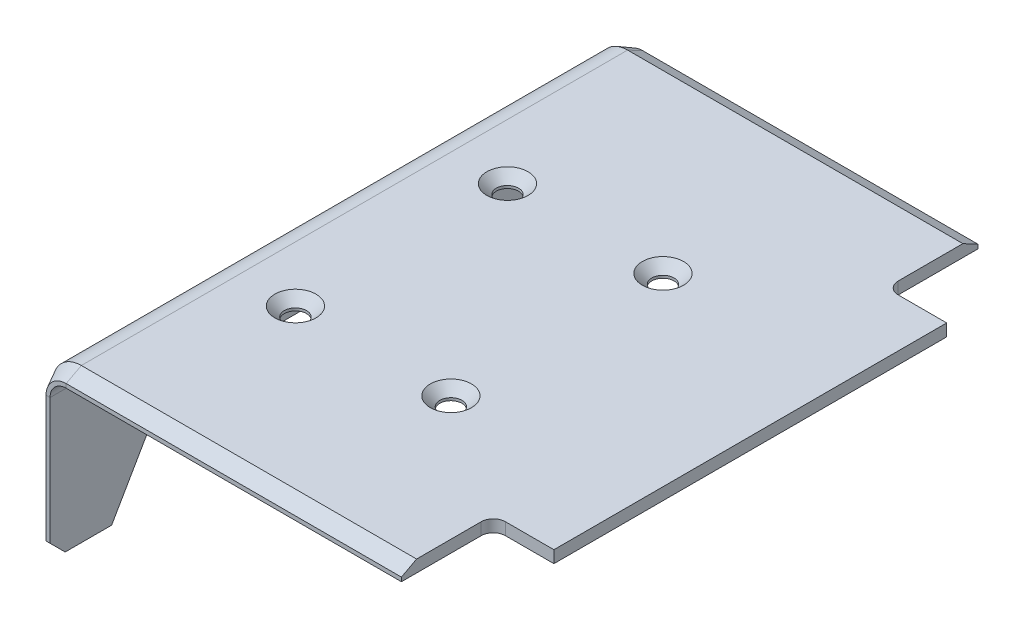
ISO-10303-21;
HEADER;
FILE_DESCRIPTION(('STEP AP214'),'2;1');
FILE_NAME('part.step','',(''),(''),'','','');
FILE_SCHEMA(('AUTOMOTIVE_DESIGN { 1 0 10303 214 1 1 1 1 }'));
ENDSEC;
DATA;
#1=APPLICATION_CONTEXT('core data for automotive mechanical design processes');
#2=APPLICATION_PROTOCOL_DEFINITION('international standard','automotive_design',2000,#1);
#3=PRODUCT_CONTEXT('',#1,'mechanical');
#4=PRODUCT('Part','Part','',(#3));
#5=PRODUCT_RELATED_PRODUCT_CATEGORY('part','',(#4));
#6=PRODUCT_DEFINITION_FORMATION('','',#4);
#7=PRODUCT_DEFINITION_CONTEXT('part definition',#1,'design');
#8=PRODUCT_DEFINITION('design','',#6,#7);
#9=PRODUCT_DEFINITION_SHAPE('','',#8);
#10=(LENGTH_UNIT() NAMED_UNIT(*) SI_UNIT(.MILLI.,.METRE.));
#11=(NAMED_UNIT(*) PLANE_ANGLE_UNIT() SI_UNIT($,.RADIAN.));
#12=(NAMED_UNIT(*) SI_UNIT($,.STERADIAN.) SOLID_ANGLE_UNIT());
#13=UNCERTAINTY_MEASURE_WITH_UNIT(LENGTH_MEASURE(1.E-05),#10,'distance_accuracy_value','');
#14=(GEOMETRIC_REPRESENTATION_CONTEXT(3) GLOBAL_UNCERTAINTY_ASSIGNED_CONTEXT((#13)) GLOBAL_UNIT_ASSIGNED_CONTEXT((#10,
#11,#12)) REPRESENTATION_CONTEXT('',''));
#15=CARTESIAN_POINT('',(0.,0.,0.));
#16=DIRECTION('',(0.,0.,1.));
#17=DIRECTION('',(1.,0.,0.));
#18=AXIS2_PLACEMENT_3D('',#15,#16,#17);
#19=CARTESIAN_POINT('',(-91.,70.,142.75));
#20=DIRECTION('',(0.,0.,-1.));
#21=DIRECTION('',(-1.,0.,0.));
#22=AXIS2_PLACEMENT_3D('',#19,#20,#21);
#23=CYLINDRICAL_SURFACE('',#22,14.);
#24=DIRECTION('',(0.,0.,-1.));
#25=VECTOR('',#24,1.);
#26=CARTESIAN_POINT('',(-91.,84.,142.75));
#27=LINE('',#26,#25);
#28=CARTESIAN_POINT('',(-90.9999999999998,84.,135.25));
#29=VERTEX_POINT('',#28);
#30=CARTESIAN_POINT('',(-90.9999999999998,84.,-135.25));
#31=VERTEX_POINT('',#30);
#32=EDGE_CURVE('E229',#29,#31,#27,.T.);
#33=ORIENTED_EDGE('',*,*,#32,.T.);
#34=CARTESIAN_POINT('',(-91.,70.,-135.25));
#35=DIRECTION('',(0.,0.,1.));
#36=DIRECTION('',(1.,0.,0.));
#37=AXIS2_PLACEMENT_3D('',#34,#35,#36);
#38=CIRCLE('',#37,14.);
#39=CARTESIAN_POINT('',(-105.,70.0000000000001,-135.25));
#40=VERTEX_POINT('',#39);
#41=EDGE_CURVE('E541',#31,#40,#38,.T.);
#42=ORIENTED_EDGE('',*,*,#41,.T.);
#43=DIRECTION('',(0.,0.,-1.));
#44=VECTOR('',#43,1.);
#45=CARTESIAN_POINT('',(-105.,69.9999999999999,142.75));
#46=LINE('',#45,#44);
#47=CARTESIAN_POINT('',(-105.,70.0000000000001,135.25));
#48=VERTEX_POINT('',#47);
#49=EDGE_CURVE('E234',#48,#40,#46,.T.);
#50=ORIENTED_EDGE('',*,*,#49,.F.);
#51=CARTESIAN_POINT('',(-91.,70.,135.25));
#52=DIRECTION('',(0.,0.,1.));
#53=DIRECTION('',(1.,0.,0.));
#54=AXIS2_PLACEMENT_3D('',#51,#52,#53);
#55=CIRCLE('',#54,14.);
#56=EDGE_CURVE('E447',#29,#48,#55,.T.);
#57=ORIENTED_EDGE('',*,*,#56,.F.);
#58=EDGE_LOOP('',(#33,#42,#50,#57));
#59=FACE_BOUND('',#58,.T.);
#60=ADVANCED_FACE('F34',(#59),#23,.T.);
#61=CARTESIAN_POINT('',(-105.,0.,142.75));
#62=DIRECTION('',(-1.,0.,0.));
#63=DIRECTION('',(0.,-1.,0.));
#64=AXIS2_PLACEMENT_3D('',#61,#62,#63);
#65=PLANE('',#64);
#66=DIRECTION('',(0.,-1.,0.));
#67=VECTOR('',#66,1.);
#68=CARTESIAN_POINT('',(-105.,70.0000000000001,-135.25));
#69=LINE('',#68,#67);
#70=CARTESIAN_POINT('',(-105.,-2.50000000000083,-135.25));
#71=VERTEX_POINT('',#70);
#72=EDGE_CURVE('E321',#40,#71,#69,.T.);
#73=ORIENTED_EDGE('',*,*,#72,.T.);
#74=DIRECTION('',(0.,0.,1.));
#75=VECTOR('',#74,1.);
#76=CARTESIAN_POINT('',(-105.,-2.5,-142.75));
#77=LINE('',#76,#75);
#78=CARTESIAN_POINT('',(-105.,-2.5,-104.193375672974));
#79=VERTEX_POINT('',#78);
#80=EDGE_CURVE('E267',#71,#79,#77,.T.);
#81=ORIENTED_EDGE('',*,*,#80,.T.);
#82=DIRECTION('',(0.,-0.866025403784436,-0.500000000000004));
#83=VECTOR('',#82,1.);
#84=CARTESIAN_POINT('',(-105.,0.,-102.75));
#85=LINE('',#84,#83);
#86=CARTESIAN_POINT('',(-105.,35.0000000000001,-82.5427405783628));
#87=VERTEX_POINT('',#86);
#88=EDGE_CURVE('E385',#87,#79,#85,.T.);
#89=ORIENTED_EDGE('',*,*,#88,.F.);
#90=CARTESIAN_POINT('',(-105.,25.,-65.2222325026741));
#91=DIRECTION('',(-1.,0.,0.));
#92=DIRECTION('',(0.,0.,-1.));
#93=AXIS2_PLACEMENT_3D('',#90,#91,#92);
#94=CIRCLE('',#93,20.);
#95=CARTESIAN_POINT('',(-105.,45.,-65.2222325026741));
#96=VERTEX_POINT('',#95);
#97=EDGE_CURVE('E397',#96,#87,#94,.T.);
#98=ORIENTED_EDGE('',*,*,#97,.F.);
#99=DIRECTION('',(0.,0.,-1.));
#100=VECTOR('',#99,1.);
#101=CARTESIAN_POINT('',(-105.,45.,-65.2222325026741));
#102=LINE('',#101,#100);
#103=CARTESIAN_POINT('',(-105.,45.,74.7222325026741));
#104=VERTEX_POINT('',#103);
#105=EDGE_CURVE('E391',#104,#96,#102,.T.);
#106=ORIENTED_EDGE('',*,*,#105,.F.);
#107=CARTESIAN_POINT('',(-105.,25.,74.7222325026741));
#108=DIRECTION('',(-1.,0.,0.));
#109=DIRECTION('',(0.,0.,1.));
#110=AXIS2_PLACEMENT_3D('',#107,#108,#109);
#111=CIRCLE('',#110,20.);
#112=CARTESIAN_POINT('',(-105.,35.0000000000001,92.0427405783628));
#113=VERTEX_POINT('',#112);
#114=EDGE_CURVE('E389',#113,#104,#111,.T.);
#115=ORIENTED_EDGE('',*,*,#114,.F.);
#116=DIRECTION('',(0.,0.866025403784436,-0.500000000000004));
#117=VECTOR('',#116,1.);
#118=CARTESIAN_POINT('',(-105.,35.0000000000001,92.0427405783628));
#119=LINE('',#118,#117);
#120=CARTESIAN_POINT('',(-105.,0.,112.25));
#121=VERTEX_POINT('',#120);
#122=EDGE_CURVE('E382',#121,#113,#119,.T.);
#123=ORIENTED_EDGE('',*,*,#122,.F.);
#124=DIRECTION('',(0.,0.,-1.));
#125=VECTOR('',#124,1.);
#126=CARTESIAN_POINT('',(-105.,0.,142.75));
#127=LINE('',#126,#125);
#128=CARTESIAN_POINT('',(-105.,1.94289029309402E-13,135.25));
#129=VERTEX_POINT('',#128);
#130=EDGE_CURVE('E367',#129,#121,#127,.T.);
#131=ORIENTED_EDGE('',*,*,#130,.F.);
#132=DIRECTION('',(0.,-1.,0.));
#133=VECTOR('',#132,1.);
#134=CARTESIAN_POINT('',(-105.,70.0000000000001,135.25));
#135=LINE('',#134,#133);
#136=EDGE_CURVE('E453',#48,#129,#135,.T.);
#137=ORIENTED_EDGE('',*,*,#136,.F.);
#138=ORIENTED_EDGE('',*,*,#49,.T.);
#139=EDGE_LOOP('',(#73,#81,#89,#98,#106,#115,#123,#131,#137,#138));
#140=FACE_BOUND('',#139,.T.);
#141=ADVANCED_FACE('F328',(#140),#65,.T.);
#142=CARTESIAN_POINT('',(-105.,69.9999999999999,-142.75));
#143=DIRECTION('',(0.,0.,-1.));
#144=DIRECTION('',(-1.,0.,0.));
#145=AXIS2_PLACEMENT_3D('',#142,#143,#144);
#146=PLANE('',#145);
#147=DIRECTION('',(1.,0.,0.));
#148=VECTOR('',#147,1.);
#149=CARTESIAN_POINT('',(-105.,69.9999999999999,-142.75));
#150=LINE('',#149,#148);
#151=CARTESIAN_POINT('',(-101.,70.0000000000001,-142.75));
#152=VERTEX_POINT('',#151);
#153=CARTESIAN_POINT('',(-99.,70.,-142.75));
#154=VERTEX_POINT('',#153);
#155=EDGE_CURVE('E240',#152,#154,#150,.T.);
#156=ORIENTED_EDGE('',*,*,#155,.F.);
#157=CARTESIAN_POINT('',(-91.,70.,-142.75));
#158=DIRECTION('',(0.,0.,1.));
#159=DIRECTION('',(1.,0.,0.));
#160=AXIS2_PLACEMENT_3D('',#157,#158,#159);
#161=CIRCLE('',#160,10.);
#162=CARTESIAN_POINT('',(-90.9999999999998,80.,-142.75));
#163=VERTEX_POINT('',#162);
#164=EDGE_CURVE('E500',#163,#152,#161,.T.);
#165=ORIENTED_EDGE('',*,*,#164,.F.);
#166=DIRECTION('',(0.,1.,0.));
#167=VECTOR('',#166,1.);
#168=CARTESIAN_POINT('',(-91.,78.,-142.75));
#169=LINE('',#168,#167);
#170=CARTESIAN_POINT('',(-91.,78.,-142.75));
#171=VERTEX_POINT('',#170);
#172=EDGE_CURVE('E231',#171,#163,#169,.T.);
#173=ORIENTED_EDGE('',*,*,#172,.F.);
#174=CARTESIAN_POINT('',(-91.,70.,-142.75));
#175=DIRECTION('',(0.,0.,1.));
#176=DIRECTION('',(1.,0.,0.));
#177=AXIS2_PLACEMENT_3D('',#174,#175,#176);
#178=CIRCLE('',#177,8.);
#179=EDGE_CURVE('E348',#154,#171,#178,.F.);
#180=ORIENTED_EDGE('',*,*,#179,.F.);
#181=EDGE_LOOP('',(#156,#165,#173,#180));
#182=FACE_BOUND('',#181,.T.);
#183=ADVANCED_FACE('F497',(#182),#146,.T.);
#184=CARTESIAN_POINT('',(-91.,78.,-142.75));
#185=DIRECTION('',(0.,0.,-1.));
#186=DIRECTION('',(-1.,0.,0.));
#187=AXIS2_PLACEMENT_3D('',#184,#185,#186);
#188=PLANE('',#187);
#189=DIRECTION('',(0.,1.,0.));
#190=VECTOR('',#189,1.);
#191=CARTESIAN_POINT('',(-99.,0.,-142.75));
#192=LINE('',#191,#190);
#193=CARTESIAN_POINT('',(-99.,5.00000000000006,-142.75));
#194=VERTEX_POINT('',#193);
#195=EDGE_CURVE('E345',#194,#154,#192,.T.);
#196=ORIENTED_EDGE('',*,*,#195,.F.);
#197=DIRECTION('',(-1.,0.,0.));
#198=VECTOR('',#197,1.);
#199=CARTESIAN_POINT('',(-91.,5.00000000000006,-142.75));
#200=LINE('',#199,#198);
#201=CARTESIAN_POINT('',(-101.,5.00000000000006,-142.75));
#202=VERTEX_POINT('',#201);
#203=EDGE_CURVE('E316',#194,#202,#200,.T.);
#204=ORIENTED_EDGE('',*,*,#203,.T.);
#205=DIRECTION('',(0.,-1.,0.));
#206=VECTOR('',#205,1.);
#207=CARTESIAN_POINT('',(-101.,70.0000000000001,-142.75));
#208=LINE('',#207,#206);
#209=EDGE_CURVE('E324',#152,#202,#208,.T.);
#210=ORIENTED_EDGE('',*,*,#209,.F.);
#211=ORIENTED_EDGE('',*,*,#155,.T.);
#212=EDGE_LOOP('',(#196,#204,#210,#211));
#213=FACE_BOUND('',#212,.T.);
#214=ADVANCED_FACE('F343',(#213),#188,.T.);
#215=CARTESIAN_POINT('',(-91.,84.,142.75));
#216=DIRECTION('',(0.,0.,1.));
#217=DIRECTION('',(1.,0.,0.));
#218=AXIS2_PLACEMENT_3D('',#215,#216,#217);
#219=PLANE('',#218);
#220=DIRECTION('',(0.,-1.,0.));
#221=VECTOR('',#220,1.);
#222=CARTESIAN_POINT('',(-91.,84.,142.75));
#223=LINE('',#222,#221);
#224=CARTESIAN_POINT('',(-90.9999999999998,80.,142.75));
#225=VERTEX_POINT('',#224);
#226=CARTESIAN_POINT('',(-91.,78.,142.75));
#227=VERTEX_POINT('',#226);
#228=EDGE_CURVE('E246',#225,#227,#223,.T.);
#229=ORIENTED_EDGE('',*,*,#228,.F.);
#230=CARTESIAN_POINT('',(-91.,70.,142.75));
#231=DIRECTION('',(0.,0.,1.));
#232=DIRECTION('',(1.,0.,0.));
#233=AXIS2_PLACEMENT_3D('',#230,#231,#232);
#234=CIRCLE('',#233,10.);
#235=CARTESIAN_POINT('',(-101.,70.0000000000001,142.75));
#236=VERTEX_POINT('',#235);
#237=EDGE_CURVE('E445',#225,#236,#234,.T.);
#238=ORIENTED_EDGE('',*,*,#237,.T.);
#239=DIRECTION('',(-1.,0.,0.));
#240=VECTOR('',#239,1.);
#241=CARTESIAN_POINT('',(-99.,70.,142.75));
#242=LINE('',#241,#240);
#243=CARTESIAN_POINT('',(-99.,70.,142.75));
#244=VERTEX_POINT('',#243);
#245=EDGE_CURVE('E243',#244,#236,#242,.T.);
#246=ORIENTED_EDGE('',*,*,#245,.F.);
#247=CARTESIAN_POINT('',(-91.,70.,142.75));
#248=DIRECTION('',(0.,0.,1.));
#249=DIRECTION('',(1.,0.,0.));
#250=AXIS2_PLACEMENT_3D('',#247,#248,#249);
#251=CIRCLE('',#250,8.);
#252=EDGE_CURVE('E363',#244,#227,#251,.F.);
#253=ORIENTED_EDGE('',*,*,#252,.T.);
#254=EDGE_LOOP('',(#229,#238,#246,#253));
#255=FACE_BOUND('',#254,.T.);
#256=ADVANCED_FACE('F416',(#255),#219,.T.);
#257=CARTESIAN_POINT('',(-99.,0.,142.75));
#258=DIRECTION('',(0.,-1.,0.));
#259=DIRECTION('',(1.,0.,0.));
#260=AXIS2_PLACEMENT_3D('',#257,#258,#259);
#261=PLANE('',#260);
#262=DIRECTION('',(0.,0.,-1.));
#263=VECTOR('',#262,1.);
#264=CARTESIAN_POINT('',(-99.,0.,142.75));
#265=LINE('',#264,#263);
#266=CARTESIAN_POINT('',(-99.,0.,135.25));
#267=VERTEX_POINT('',#266);
#268=CARTESIAN_POINT('',(-99.,0.,112.25));
#269=VERTEX_POINT('',#268);
#270=EDGE_CURVE('E365',#267,#269,#265,.T.);
#271=ORIENTED_EDGE('',*,*,#270,.F.);
#272=DIRECTION('',(-1.,0.,0.));
#273=VECTOR('',#272,1.);
#274=CARTESIAN_POINT('',(-99.,0.,135.25));
#275=LINE('',#274,#273);
#276=EDGE_CURVE('E306',#267,#129,#275,.T.);
#277=ORIENTED_EDGE('',*,*,#276,.T.);
#278=ORIENTED_EDGE('',*,*,#130,.T.);
#279=DIRECTION('',(-1.,0.,0.));
#280=VECTOR('',#279,1.);
#281=CARTESIAN_POINT('',(105.,0.,112.25));
#282=LINE('',#281,#280);
#283=EDGE_CURVE('E374',#269,#121,#282,.T.);
#284=ORIENTED_EDGE('',*,*,#283,.F.);
#285=EDGE_LOOP('',(#271,#277,#278,#284));
#286=FACE_BOUND('',#285,.T.);
#287=ADVANCED_FACE('F373',(#286),#261,.T.);
#288=CARTESIAN_POINT('',(-91.,70.,142.75));
#289=DIRECTION('',(0.,0.,1.));
#290=DIRECTION('',(1.,0.,0.));
#291=AXIS2_PLACEMENT_3D('',#288,#289,#290);
#292=PLANE('',#291);
#293=DIRECTION('',(0.,-1.,0.));
#294=VECTOR('',#293,1.);
#295=CARTESIAN_POINT('',(-101.,70.0000000000001,142.75));
#296=LINE('',#295,#294);
#297=CARTESIAN_POINT('',(-101.,7.50000000000001,142.75));
#298=VERTEX_POINT('',#297);
#299=EDGE_CURVE('E450',#236,#298,#296,.T.);
#300=ORIENTED_EDGE('',*,*,#299,.T.);
#301=DIRECTION('',(1.,0.,0.));
#302=VECTOR('',#301,1.);
#303=CARTESIAN_POINT('',(-91.,7.50000000000001,142.75));
#304=LINE('',#303,#302);
#305=CARTESIAN_POINT('',(-99.,7.50000000000001,142.75));
#306=VERTEX_POINT('',#305);
#307=EDGE_CURVE('E311',#298,#306,#304,.T.);
#308=ORIENTED_EDGE('',*,*,#307,.T.);
#309=DIRECTION('',(0.,1.,0.));
#310=VECTOR('',#309,1.);
#311=CARTESIAN_POINT('',(-99.,0.,142.75));
#312=LINE('',#311,#310);
#313=EDGE_CURVE('E409',#306,#244,#312,.T.);
#314=ORIENTED_EDGE('',*,*,#313,.T.);
#315=ORIENTED_EDGE('',*,*,#245,.T.);
#316=EDGE_LOOP('',(#300,#308,#314,#315));
#317=FACE_BOUND('',#316,.T.);
#318=ADVANCED_FACE('F495',(#317),#292,.T.);
#319=CARTESIAN_POINT('',(-99.,70.,142.75));
#320=DIRECTION('',(0.,0.,1.));
#321=DIRECTION('',(1.,0.,0.));
#322=AXIS2_PLACEMENT_3D('',#319,#320,#321);
#323=PLANE('',#322);
#324=DIRECTION('',(0.,1.,0.));
#325=VECTOR('',#324,1.);
#326=CARTESIAN_POINT('',(75.0000000000002,-2.50000000000082,142.75));
#327=LINE('',#326,#325);
#328=CARTESIAN_POINT('',(75.0000000000002,78.,142.75));
#329=VERTEX_POINT('',#328);
#330=CARTESIAN_POINT('',(75.0000000000002,80.,142.75));
#331=VERTEX_POINT('',#330);
#332=EDGE_CURVE('E212',#329,#331,#327,.T.);
#333=ORIENTED_EDGE('',*,*,#332,.T.);
#334=DIRECTION('',(1.,0.,0.));
#335=VECTOR('',#334,1.);
#336=CARTESIAN_POINT('',(-90.9999999999998,80.,142.75));
#337=LINE('',#336,#335);
#338=EDGE_CURVE('E433',#225,#331,#337,.T.);
#339=ORIENTED_EDGE('',*,*,#338,.F.);
#340=ORIENTED_EDGE('',*,*,#228,.T.);
#341=DIRECTION('',(1.,0.,0.));
#342=VECTOR('',#341,1.);
#343=CARTESIAN_POINT('',(-105.,78.,142.75));
#344=LINE('',#343,#342);
#345=EDGE_CURVE('E352',#227,#329,#344,.T.);
#346=ORIENTED_EDGE('',*,*,#345,.T.);
#347=EDGE_LOOP('',(#333,#339,#340,#346));
#348=FACE_BOUND('',#347,.T.);
#349=ADVANCED_FACE('F430',(#348),#323,.T.);
#350=CARTESIAN_POINT('',(-105.,78.,142.75));
#351=DIRECTION('',(0.,1.,0.));
#352=DIRECTION('',(0.,0.,1.));
#353=AXIS2_PLACEMENT_3D('',#350,#351,#352);
#354=PLANE('',#353);
#355=CARTESIAN_POINT('',(-63.5,78.,-48.25));
#356=DIRECTION('',(0.,1.,0.));
#357=DIRECTION('',(0.,0.,1.));
#358=AXIS2_PLACEMENT_3D('',#355,#356,#357);
#359=CIRCLE('',#358,5.49999999999998);
#360=CARTESIAN_POINT('',(-63.5,78.,-42.75));
#361=VERTEX_POINT('',#360);
#362=EDGE_CURVE('E279',#361,#361,#359,.T.);
#363=ORIENTED_EDGE('',*,*,#362,.T.);
#364=EDGE_LOOP('',(#363));
#365=FACE_BOUND('',#364,.T.);
#366=CARTESIAN_POINT('',(13.5,78.,-48.25));
#367=DIRECTION('',(0.,1.,0.));
#368=DIRECTION('',(0.,0.,1.));
#369=AXIS2_PLACEMENT_3D('',#366,#367,#368);
#370=CIRCLE('',#369,5.49999999999998);
#371=CARTESIAN_POINT('',(13.5,78.,-42.75));
#372=VERTEX_POINT('',#371);
#373=EDGE_CURVE('E274',#372,#372,#370,.T.);
#374=ORIENTED_EDGE('',*,*,#373,.T.);
#375=EDGE_LOOP('',(#374));
#376=FACE_BOUND('',#375,.T.);
#377=CARTESIAN_POINT('',(13.5,78.,56.75));
#378=DIRECTION('',(0.,1.,0.));
#379=DIRECTION('',(0.,0.,1.));
#380=AXIS2_PLACEMENT_3D('',#377,#378,#379);
#381=CIRCLE('',#380,5.49999999999998);
#382=CARTESIAN_POINT('',(13.5,78.,62.25));
#383=VERTEX_POINT('',#382);
#384=EDGE_CURVE('E269',#383,#383,#381,.T.);
#385=ORIENTED_EDGE('',*,*,#384,.T.);
#386=EDGE_LOOP('',(#385));
#387=FACE_BOUND('',#386,.T.);
#388=CARTESIAN_POINT('',(-63.5,78.,56.75));
#389=DIRECTION('',(0.,1.,0.));
#390=DIRECTION('',(0.,0.,1.));
#391=AXIS2_PLACEMENT_3D('',#388,#389,#390);
#392=CIRCLE('',#391,5.49999999999998);
#393=CARTESIAN_POINT('',(-63.5,78.,62.25));
#394=VERTEX_POINT('',#393);
#395=EDGE_CURVE('E264',#394,#394,#392,.T.);
#396=ORIENTED_EDGE('',*,*,#395,.T.);
#397=EDGE_LOOP('',(#396));
#398=FACE_BOUND('',#397,.T.);
#399=DIRECTION('',(-1.,0.,0.));
#400=VECTOR('',#399,1.);
#401=CARTESIAN_POINT('',(-105.,78.,97.25));
#402=LINE('',#401,#400);
#403=CARTESIAN_POINT('',(105.,78.,97.25));
#404=VERTEX_POINT('',#403);
#405=CARTESIAN_POINT('',(81.0000000000003,78.,97.25));
#406=VERTEX_POINT('',#405);
#407=EDGE_CURVE('E207',#404,#406,#402,.T.);
#408=ORIENTED_EDGE('',*,*,#407,.T.);
#409=CARTESIAN_POINT('',(81.0000000000003,78.,103.25));
#410=DIRECTION('',(0.,1.,0.));
#411=DIRECTION('',(0.,0.,1.));
#412=AXIS2_PLACEMENT_3D('',#409,#410,#411);
#413=CIRCLE('',#412,6.);
#414=CARTESIAN_POINT('',(75.0000000000003,78.,103.25));
#415=VERTEX_POINT('',#414);
#416=EDGE_CURVE('E304',#406,#415,#413,.T.);
#417=ORIENTED_EDGE('',*,*,#416,.T.);
#418=DIRECTION('',(0.,0.,1.));
#419=VECTOR('',#418,1.);
#420=CARTESIAN_POINT('',(75.0000000000003,78.,142.75));
#421=LINE('',#420,#419);
#422=EDGE_CURVE('E426',#415,#329,#421,.T.);
#423=ORIENTED_EDGE('',*,*,#422,.T.);
#424=ORIENTED_EDGE('',*,*,#345,.F.);
#425=DIRECTION('',(0.,0.,-1.));
#426=VECTOR('',#425,1.);
#427=CARTESIAN_POINT('',(-91.,78.,142.75));
#428=LINE('',#427,#426);
#429=EDGE_CURVE('E359',#227,#171,#428,.T.);
#430=ORIENTED_EDGE('',*,*,#429,.T.);
#431=DIRECTION('',(1.,0.,0.));
#432=VECTOR('',#431,1.);
#433=CARTESIAN_POINT('',(-105.,78.,-142.75));
#434=LINE('',#433,#432);
#435=CARTESIAN_POINT('',(75.0000000000002,78.,-142.75));
#436=VERTEX_POINT('',#435);
#437=EDGE_CURVE('E349',#171,#436,#434,.T.);
#438=ORIENTED_EDGE('',*,*,#437,.T.);
#439=DIRECTION('',(0.,0.,1.));
#440=VECTOR('',#439,1.);
#441=CARTESIAN_POINT('',(75.0000000000002,78.,142.75));
#442=LINE('',#441,#440);
#443=CARTESIAN_POINT('',(75.0000000000002,78.,-103.25));
#444=VERTEX_POINT('',#443);
#445=EDGE_CURVE('E508',#436,#444,#442,.T.);
#446=ORIENTED_EDGE('',*,*,#445,.T.);
#447=CARTESIAN_POINT('',(81.0000000000002,78.,-103.25));
#448=DIRECTION('',(0.,1.,0.));
#449=DIRECTION('',(0.,0.,1.));
#450=AXIS2_PLACEMENT_3D('',#447,#448,#449);
#451=CIRCLE('',#450,6.);
#452=CARTESIAN_POINT('',(81.0000000000002,78.,-97.25));
#453=VERTEX_POINT('',#452);
#454=EDGE_CURVE('E301',#444,#453,#451,.T.);
#455=ORIENTED_EDGE('',*,*,#454,.T.);
#456=DIRECTION('',(1.,0.,0.));
#457=VECTOR('',#456,1.);
#458=CARTESIAN_POINT('',(-105.,78.,-97.25));
#459=LINE('',#458,#457);
#460=CARTESIAN_POINT('',(105.,78.,-97.25));
#461=VERTEX_POINT('',#460);
#462=EDGE_CURVE('E512',#453,#461,#459,.T.);
#463=ORIENTED_EDGE('',*,*,#462,.T.);
#464=DIRECTION('',(0.,0.,-1.));
#465=VECTOR('',#464,1.);
#466=CARTESIAN_POINT('',(105.,78.,142.75));
#467=LINE('',#466,#465);
#468=EDGE_CURVE('E228',#404,#461,#467,.T.);
#469=ORIENTED_EDGE('',*,*,#468,.F.);
#470=EDGE_LOOP('',(#408,#417,#423,#424,#430,#438,#446,#455,#463,#469));
#471=FACE_BOUND('',#470,.T.);
#472=ADVANCED_FACE('F424',(#365,#376,#387,#398,#471),#354,.F.);
#473=CARTESIAN_POINT('',(105.,84.,142.75));
#474=DIRECTION('',(1.,0.,0.));
#475=DIRECTION('',(0.,1.,0.));
#476=AXIS2_PLACEMENT_3D('',#473,#474,#475);
#477=PLANE('',#476);
#478=DIRECTION('',(0.,1.,0.));
#479=VECTOR('',#478,1.);
#480=CARTESIAN_POINT('',(105.,-2.50000000000082,97.25));
#481=LINE('',#480,#479);
#482=CARTESIAN_POINT('',(105.,84.,97.25));
#483=VERTEX_POINT('',#482);
#484=EDGE_CURVE('E201',#404,#483,#481,.T.);
#485=ORIENTED_EDGE('',*,*,#484,.F.);
#486=ORIENTED_EDGE('',*,*,#468,.T.);
#487=DIRECTION('',(0.,1.,0.));
#488=VECTOR('',#487,1.);
#489=CARTESIAN_POINT('',(105.,-2.50000000000082,-97.25));
#490=LINE('',#489,#488);
#491=CARTESIAN_POINT('',(105.,84.,-97.25));
#492=VERTEX_POINT('',#491);
#493=EDGE_CURVE('E227',#461,#492,#490,.T.);
#494=ORIENTED_EDGE('',*,*,#493,.T.);
#495=DIRECTION('',(0.,0.,-1.));
#496=VECTOR('',#495,1.);
#497=CARTESIAN_POINT('',(105.,84.,142.75));
#498=LINE('',#497,#496);
#499=EDGE_CURVE('E221',#483,#492,#498,.T.);
#500=ORIENTED_EDGE('',*,*,#499,.F.);
#501=EDGE_LOOP('',(#485,#486,#494,#500));
#502=FACE_BOUND('',#501,.T.);
#503=ADVANCED_FACE('F225',(#502),#477,.T.);
#504=CARTESIAN_POINT('',(-105.,84.,142.75));
#505=DIRECTION('',(0.,1.,0.));
#506=DIRECTION('',(0.,0.,1.));
#507=AXIS2_PLACEMENT_3D('',#504,#505,#506);
#508=PLANE('',#507);
#509=DIRECTION('',(0.,0.,1.));
#510=VECTOR('',#509,1.);
#511=CARTESIAN_POINT('',(75.0000000000002,84.,142.75));
#512=LINE('',#511,#510);
#513=CARTESIAN_POINT('',(75.0000000000002,84.,103.25));
#514=VERTEX_POINT('',#513);
#515=CARTESIAN_POINT('',(75.0000000000002,84.,135.25));
#516=VERTEX_POINT('',#515);
#517=EDGE_CURVE('E213',#514,#516,#512,.T.);
#518=ORIENTED_EDGE('',*,*,#517,.F.);
#519=CARTESIAN_POINT('',(81.0000000000003,84.,103.25));
#520=DIRECTION('',(0.,1.,0.));
#521=DIRECTION('',(0.,0.,1.));
#522=AXIS2_PLACEMENT_3D('',#519,#520,#521);
#523=CIRCLE('',#522,6.);
#524=CARTESIAN_POINT('',(81.0000000000003,84.,97.25));
#525=VERTEX_POINT('',#524);
#526=EDGE_CURVE('E223',#514,#525,#523,.F.);
#527=ORIENTED_EDGE('',*,*,#526,.T.);
#528=DIRECTION('',(-1.,0.,0.));
#529=VECTOR('',#528,1.);
#530=CARTESIAN_POINT('',(105.,84.,97.25));
#531=LINE('',#530,#529);
#532=EDGE_CURVE('E204',#483,#525,#531,.T.);
#533=ORIENTED_EDGE('',*,*,#532,.F.);
#534=ORIENTED_EDGE('',*,*,#499,.T.);
#535=DIRECTION('',(1.,0.,0.));
#536=VECTOR('',#535,1.);
#537=CARTESIAN_POINT('',(75.0000000000002,84.,-97.25));
#538=LINE('',#537,#536);
#539=CARTESIAN_POINT('',(81.0000000000002,84.,-97.25));
#540=VERTEX_POINT('',#539);
#541=EDGE_CURVE('E520',#540,#492,#538,.T.);
#542=ORIENTED_EDGE('',*,*,#541,.F.);
#543=CARTESIAN_POINT('',(81.0000000000002,84.,-103.25));
#544=DIRECTION('',(0.,1.,0.));
#545=DIRECTION('',(0.,0.,1.));
#546=AXIS2_PLACEMENT_3D('',#543,#544,#545);
#547=CIRCLE('',#546,6.);
#548=CARTESIAN_POINT('',(75.0000000000002,84.,-103.25));
#549=VERTEX_POINT('',#548);
#550=EDGE_CURVE('E299',#540,#549,#547,.F.);
#551=ORIENTED_EDGE('',*,*,#550,.T.);
#552=DIRECTION('',(0.,0.,1.));
#553=VECTOR('',#552,1.);
#554=CARTESIAN_POINT('',(75.0000000000002,84.,-142.75));
#555=LINE('',#554,#553);
#556=CARTESIAN_POINT('',(75.0000000000002,84.,-135.25));
#557=VERTEX_POINT('',#556);
#558=EDGE_CURVE('E523',#557,#549,#555,.T.);
#559=ORIENTED_EDGE('',*,*,#558,.F.);
#560=DIRECTION('',(1.,0.,0.));
#561=VECTOR('',#560,1.);
#562=CARTESIAN_POINT('',(-90.9999999999998,84.,-135.25));
#563=LINE('',#562,#561);
#564=EDGE_CURVE('E534',#31,#557,#563,.T.);
#565=ORIENTED_EDGE('',*,*,#564,.F.);
#566=ORIENTED_EDGE('',*,*,#32,.F.);
#567=DIRECTION('',(1.,0.,0.));
#568=VECTOR('',#567,1.);
#569=CARTESIAN_POINT('',(-90.9999999999998,84.,135.25));
#570=LINE('',#569,#568);
#571=EDGE_CURVE('E436',#29,#516,#570,.T.);
#572=ORIENTED_EDGE('',*,*,#571,.T.);
#573=EDGE_LOOP('',(#518,#527,#533,#534,#542,#551,#559,#565,#566,#572));
#574=FACE_BOUND('',#573,.T.);
#575=CARTESIAN_POINT('',(-63.5,84.,-48.25));
#576=DIRECTION('',(0.,1.,0.));
#577=DIRECTION('',(0.,0.,1.));
#578=AXIS2_PLACEMENT_3D('',#575,#576,#577);
#579=CIRCLE('',#578,10.2);
#580=CARTESIAN_POINT('',(-63.5,84.,-38.05));
#581=VERTEX_POINT('',#580);
#582=EDGE_CURVE('E455',#581,#581,#579,.T.);
#583=ORIENTED_EDGE('',*,*,#582,.F.);
#584=EDGE_LOOP('',(#583));
#585=FACE_BOUND('',#584,.T.);
#586=CARTESIAN_POINT('',(13.5,84.,-48.25));
#587=DIRECTION('',(0.,1.,0.));
#588=DIRECTION('',(0.,0.,1.));
#589=AXIS2_PLACEMENT_3D('',#586,#587,#588);
#590=CIRCLE('',#589,10.2);
#591=CARTESIAN_POINT('',(13.5,84.,-38.05));
#592=VERTEX_POINT('',#591);
#593=EDGE_CURVE('E282',#592,#592,#590,.T.);
#594=ORIENTED_EDGE('',*,*,#593,.F.);
#595=EDGE_LOOP('',(#594));
#596=FACE_BOUND('',#595,.T.);
#597=CARTESIAN_POINT('',(13.5,84.,56.75));
#598=DIRECTION('',(0.,1.,0.));
#599=DIRECTION('',(0.,0.,1.));
#600=AXIS2_PLACEMENT_3D('',#597,#598,#599);
#601=CIRCLE('',#600,10.2);
#602=CARTESIAN_POINT('',(13.5,84.,66.95));
#603=VERTEX_POINT('',#602);
#604=EDGE_CURVE('E277',#603,#603,#601,.T.);
#605=ORIENTED_EDGE('',*,*,#604,.F.);
#606=EDGE_LOOP('',(#605));
#607=FACE_BOUND('',#606,.T.);
#608=CARTESIAN_POINT('',(-63.5,84.,56.75));
#609=DIRECTION('',(0.,1.,0.));
#610=DIRECTION('',(0.,0.,1.));
#611=AXIS2_PLACEMENT_3D('',#608,#609,#610);
#612=CIRCLE('',#611,10.2);
#613=CARTESIAN_POINT('',(-63.5,84.,66.95));
#614=VERTEX_POINT('',#613);
#615=EDGE_CURVE('E272',#614,#614,#612,.T.);
#616=ORIENTED_EDGE('',*,*,#615,.F.);
#617=EDGE_LOOP('',(#616));
#618=FACE_BOUND('',#617,.T.);
#619=ADVANCED_FACE('F218',(#574,#585,#596,#607,#618),#508,.T.);
#620=CARTESIAN_POINT('',(-99.,0.,142.75));
#621=DIRECTION('',(-1.,0.,0.));
#622=DIRECTION('',(0.,-1.,0.));
#623=AXIS2_PLACEMENT_3D('',#620,#621,#622);
#624=PLANE('',#623);
#625=ORIENTED_EDGE('',*,*,#313,.F.);
#626=DIRECTION('',(0.,0.70710678118655,0.707106781186545));
#627=VECTOR('',#626,1.);
#628=CARTESIAN_POINT('',(-99.,0.,135.25));
#629=LINE('',#628,#627);
#630=EDGE_CURVE('E314',#306,#267,#629,.F.);
#631=ORIENTED_EDGE('',*,*,#630,.T.);
#632=ORIENTED_EDGE('',*,*,#270,.T.);
#633=DIRECTION('',(0.,0.866025403784436,-0.500000000000004));
#634=VECTOR('',#633,1.);
#635=CARTESIAN_POINT('',(-99.,-13.2068874077128,119.875));
#636=LINE('',#635,#634);
#637=CARTESIAN_POINT('',(-99.,35.0000000000001,92.0427405783628));
#638=VERTEX_POINT('',#637);
#639=EDGE_CURVE('E248',#269,#638,#636,.T.);
#640=ORIENTED_EDGE('',*,*,#639,.T.);
#641=CARTESIAN_POINT('',(-99.,25.,74.7222325026741));
#642=DIRECTION('',(-1.,0.,0.));
#643=DIRECTION('',(0.,-1.,0.));
#644=AXIS2_PLACEMENT_3D('',#641,#642,#643);
#645=CIRCLE('',#644,20.);
#646=CARTESIAN_POINT('',(-99.,45.,74.7222325026741));
#647=VERTEX_POINT('',#646);
#648=EDGE_CURVE('E251',#638,#647,#645,.T.);
#649=ORIENTED_EDGE('',*,*,#648,.T.);
#650=DIRECTION('',(0.,0.,-1.));
#651=VECTOR('',#650,1.);
#652=CARTESIAN_POINT('',(-99.,45.,142.75));
#653=LINE('',#652,#651);
#654=CARTESIAN_POINT('',(-99.,45.,-65.2222325026741));
#655=VERTEX_POINT('',#654);
#656=EDGE_CURVE('E254',#647,#655,#653,.T.);
#657=ORIENTED_EDGE('',*,*,#656,.T.);
#658=CARTESIAN_POINT('',(-99.,25.,-65.2222325026741));
#659=DIRECTION('',(-1.,0.,0.));
#660=DIRECTION('',(0.,-1.,0.));
#661=AXIS2_PLACEMENT_3D('',#658,#659,#660);
#662=CIRCLE('',#661,20.);
#663=CARTESIAN_POINT('',(-99.,35.0000000000001,-82.5427405783628));
#664=VERTEX_POINT('',#663);
#665=EDGE_CURVE('E257',#655,#664,#662,.T.);
#666=ORIENTED_EDGE('',*,*,#665,.T.);
#667=DIRECTION('',(0.,-0.866025403784436,-0.500000000000004));
#668=VECTOR('',#667,1.);
#669=CARTESIAN_POINT('',(-99.,106.30461831454,-41.374999999999));
#670=LINE('',#669,#668);
#671=CARTESIAN_POINT('',(-99.,-2.5,-104.193375672974));
#672=VERTEX_POINT('',#671);
#673=EDGE_CURVE('E260',#664,#672,#670,.T.);
#674=ORIENTED_EDGE('',*,*,#673,.T.);
#675=DIRECTION('',(0.,0.,1.));
#676=VECTOR('',#675,1.);
#677=CARTESIAN_POINT('',(-99.,-2.5,-142.75));
#678=LINE('',#677,#676);
#679=CARTESIAN_POINT('',(-99.,-2.5,-135.25));
#680=VERTEX_POINT('',#679);
#681=EDGE_CURVE('E340',#680,#672,#678,.T.);
#682=ORIENTED_EDGE('',*,*,#681,.F.);
#683=DIRECTION('',(0.,-0.707106781186547,0.707106781186548));
#684=VECTOR('',#683,1.);
#685=CARTESIAN_POINT('',(-99.,5.00000000000006,-142.75));
#686=LINE('',#685,#684);
#687=EDGE_CURVE('E56',#680,#194,#686,.F.);
#688=ORIENTED_EDGE('',*,*,#687,.T.);
#689=ORIENTED_EDGE('',*,*,#195,.T.);
#690=DIRECTION('',(0.,0.,-1.));
#691=VECTOR('',#690,1.);
#692=CARTESIAN_POINT('',(-99.,70.,142.75));
#693=LINE('',#692,#691);
#694=EDGE_CURVE('E362',#244,#154,#693,.T.);
#695=ORIENTED_EDGE('',*,*,#694,.F.);
#696=EDGE_LOOP('',(#625,#631,#632,#640,#649,#657,#666,#674,#682,#688,#689,#695));
#697=FACE_BOUND('',#696,.T.);
#698=ADVANCED_FACE('F473',(#697),#624,.F.);
#699=CARTESIAN_POINT('',(-91.,70.,142.75));
#700=DIRECTION('',(0.,0.,-1.));
#701=DIRECTION('',(-1.,0.,0.));
#702=AXIS2_PLACEMENT_3D('',#699,#700,#701);
#703=CYLINDRICAL_SURFACE('',#702,8.);
#704=ORIENTED_EDGE('',*,*,#179,.T.);
#705=ORIENTED_EDGE('',*,*,#429,.F.);
#706=ORIENTED_EDGE('',*,*,#252,.F.);
#707=ORIENTED_EDGE('',*,*,#694,.T.);
#708=EDGE_LOOP('',(#704,#705,#706,#707));
#709=FACE_BOUND('',#708,.T.);
#710=ADVANCED_FACE('F420',(#709),#703,.F.);
#711=CARTESIAN_POINT('',(-91.,70.,-142.75));
#712=DIRECTION('',(0.,0.,1.));
#713=DIRECTION('',(1.,0.,0.));
#714=AXIS2_PLACEMENT_3D('',#711,#712,#713);
#715=PLANE('',#714);
#716=DIRECTION('',(1.,0.,0.));
#717=VECTOR('',#716,1.);
#718=CARTESIAN_POINT('',(-90.9999999999998,80.,-142.75));
#719=LINE('',#718,#717);
#720=CARTESIAN_POINT('',(75.0000000000002,80.,-142.75));
#721=VERTEX_POINT('',#720);
#722=EDGE_CURVE('E505',#163,#721,#719,.T.);
#723=ORIENTED_EDGE('',*,*,#722,.T.);
#724=DIRECTION('',(0.,1.,0.));
#725=VECTOR('',#724,1.);
#726=CARTESIAN_POINT('',(75.0000000000002,-2.50000000000082,-142.75));
#727=LINE('',#726,#725);
#728=EDGE_CURVE('E506',#436,#721,#727,.T.);
#729=ORIENTED_EDGE('',*,*,#728,.F.);
#730=ORIENTED_EDGE('',*,*,#437,.F.);
#731=ORIENTED_EDGE('',*,*,#172,.T.);
#732=EDGE_LOOP('',(#723,#729,#730,#731));
#733=FACE_BOUND('',#732,.T.);
#734=ADVANCED_FACE('F503',(#733),#715,.F.);
#735=CARTESIAN_POINT('',(105.,0.,-102.75));
#736=DIRECTION('',(0.,0.500000000000004,-0.866025403784436));
#737=DIRECTION('',(0.,0.866025403784436,0.500000000000004));
#738=AXIS2_PLACEMENT_3D('',#735,#736,#737);
#739=PLANE('',#738);
#740=DIRECTION('',(-1.,0.,0.));
#741=VECTOR('',#740,1.);
#742=CARTESIAN_POINT('',(105.,35.0000000000001,-82.5427405783628));
#743=LINE('',#742,#741);
#744=EDGE_CURVE('E355',#664,#87,#743,.T.);
#745=ORIENTED_EDGE('',*,*,#744,.T.);
#746=ORIENTED_EDGE('',*,*,#88,.T.);
#747=DIRECTION('',(-1.,0.,0.));
#748=VECTOR('',#747,1.);
#749=CARTESIAN_POINT('',(-99.,-2.5,-104.193375672974));
#750=LINE('',#749,#748);
#751=EDGE_CURVE('E339',#672,#79,#750,.T.);
#752=ORIENTED_EDGE('',*,*,#751,.F.);
#753=ORIENTED_EDGE('',*,*,#673,.F.);
#754=EDGE_LOOP('',(#745,#746,#752,#753));
#755=FACE_BOUND('',#754,.T.);
#756=ADVANCED_FACE('F476',(#755),#739,.F.);
#757=CARTESIAN_POINT('',(105.,25.,-65.2222325026741));
#758=DIRECTION('',(-1.,0.,0.));
#759=DIRECTION('',(0.,0.,1.));
#760=AXIS2_PLACEMENT_3D('',#757,#758,#759);
#761=CYLINDRICAL_SURFACE('',#760,20.);
#762=DIRECTION('',(-1.,0.,0.));
#763=VECTOR('',#762,1.);
#764=CARTESIAN_POINT('',(105.,45.,-65.2222325026741));
#765=LINE('',#764,#763);
#766=EDGE_CURVE('E402',#655,#96,#765,.T.);
#767=ORIENTED_EDGE('',*,*,#766,.T.);
#768=ORIENTED_EDGE('',*,*,#97,.T.);
#769=ORIENTED_EDGE('',*,*,#744,.F.);
#770=ORIENTED_EDGE('',*,*,#665,.F.);
#771=EDGE_LOOP('',(#767,#768,#769,#770));
#772=FACE_BOUND('',#771,.T.);
#773=ADVANCED_FACE('F479',(#772),#761,.F.);
#774=CARTESIAN_POINT('',(105.,45.,-65.2222325026741));
#775=DIRECTION('',(0.,1.,0.));
#776=DIRECTION('',(0.,0.,1.));
#777=AXIS2_PLACEMENT_3D('',#774,#775,#776);
#778=PLANE('',#777);
#779=DIRECTION('',(-1.,0.,0.));
#780=VECTOR('',#779,1.);
#781=CARTESIAN_POINT('',(105.,45.,74.7222325026741));
#782=LINE('',#781,#780);
#783=EDGE_CURVE('E404',#647,#104,#782,.T.);
#784=ORIENTED_EDGE('',*,*,#783,.T.);
#785=ORIENTED_EDGE('',*,*,#105,.T.);
#786=ORIENTED_EDGE('',*,*,#766,.F.);
#787=ORIENTED_EDGE('',*,*,#656,.F.);
#788=EDGE_LOOP('',(#784,#785,#786,#787));
#789=FACE_BOUND('',#788,.T.);
#790=ADVANCED_FACE('F482',(#789),#778,.F.);
#791=CARTESIAN_POINT('',(105.,25.,74.7222325026741));
#792=DIRECTION('',(-1.,0.,0.));
#793=DIRECTION('',(0.,0.,1.));
#794=AXIS2_PLACEMENT_3D('',#791,#792,#793);
#795=CYLINDRICAL_SURFACE('',#794,20.);
#796=DIRECTION('',(-1.,0.,0.));
#797=VECTOR('',#796,1.);
#798=CARTESIAN_POINT('',(105.,35.0000000000001,92.0427405783628));
#799=LINE('',#798,#797);
#800=EDGE_CURVE('E384',#638,#113,#799,.T.);
#801=ORIENTED_EDGE('',*,*,#800,.T.);
#802=ORIENTED_EDGE('',*,*,#114,.T.);
#803=ORIENTED_EDGE('',*,*,#783,.F.);
#804=ORIENTED_EDGE('',*,*,#648,.F.);
#805=EDGE_LOOP('',(#801,#802,#803,#804));
#806=FACE_BOUND('',#805,.T.);
#807=ADVANCED_FACE('F486',(#806),#795,.F.);
#808=CARTESIAN_POINT('',(105.,35.0000000000001,92.0427405783628));
#809=DIRECTION('',(0.,0.500000000000004,0.866025403784436));
#810=DIRECTION('',(0.,-0.866025403784436,0.500000000000004));
#811=AXIS2_PLACEMENT_3D('',#808,#809,#810);
#812=PLANE('',#811);
#813=ORIENTED_EDGE('',*,*,#283,.T.);
#814=ORIENTED_EDGE('',*,*,#122,.T.);
#815=ORIENTED_EDGE('',*,*,#800,.F.);
#816=ORIENTED_EDGE('',*,*,#639,.F.);
#817=EDGE_LOOP('',(#813,#814,#815,#816));
#818=FACE_BOUND('',#817,.T.);
#819=ADVANCED_FACE('F381',(#818),#812,.F.);
#820=CARTESIAN_POINT('',(-99.,-2.5,-142.75));
#821=DIRECTION('',(0.,-1.,0.));
#822=DIRECTION('',(1.,0.,0.));
#823=AXIS2_PLACEMENT_3D('',#820,#821,#822);
#824=PLANE('',#823);
#825=ORIENTED_EDGE('',*,*,#80,.F.);
#826=DIRECTION('',(1.,0.,0.));
#827=VECTOR('',#826,1.);
#828=CARTESIAN_POINT('',(-99.,-2.5,-135.25));
#829=LINE('',#828,#827);
#830=EDGE_CURVE('E11',#71,#680,#829,.T.);
#831=ORIENTED_EDGE('',*,*,#830,.T.);
#832=ORIENTED_EDGE('',*,*,#681,.T.);
#833=ORIENTED_EDGE('',*,*,#751,.T.);
#834=EDGE_LOOP('',(#825,#831,#832,#833));
#835=FACE_BOUND('',#834,.T.);
#836=ADVANCED_FACE('F337',(#835),#824,.T.);
#837=CARTESIAN_POINT('',(-63.5,84.,56.75));
#838=DIRECTION('',(0.,1.,0.));
#839=DIRECTION('',(0.,0.,1.));
#840=AXIS2_PLACEMENT_3D('',#837,#838,#839);
#841=CYLINDRICAL_SURFACE('',#840,5.49999999999998);
#842=CARTESIAN_POINT('',(-63.5,79.3,56.75));
#843=DIRECTION('',(0.,1.,0.));
#844=DIRECTION('',(0.,0.,1.));
#845=AXIS2_PLACEMENT_3D('',#842,#843,#844);
#846=CIRCLE('',#845,5.49999999999999);
#847=CARTESIAN_POINT('',(-63.5,79.3,62.25));
#848=VERTEX_POINT('',#847);
#849=EDGE_CURVE('E268',#848,#848,#846,.T.);
#850=ORIENTED_EDGE('',*,*,#849,.T.);
#851=EDGE_LOOP('',(#850));
#852=FACE_BOUND('',#851,.T.);
#853=ORIENTED_EDGE('',*,*,#395,.F.);
#854=EDGE_LOOP('',(#853));
#855=FACE_BOUND('',#854,.T.);
#856=ADVANCED_FACE('F640',(#852,#855),#841,.F.);
#857=CARTESIAN_POINT('',(-63.5,84.,56.75));
#858=DIRECTION('',(0.,1.,0.));
#859=DIRECTION('',(0.,0.,1.));
#860=AXIS2_PLACEMENT_3D('',#857,#858,#859);
#861=CONICAL_SURFACE('',#860,10.2,0.785398163397448);
#862=ORIENTED_EDGE('',*,*,#849,.F.);
#863=EDGE_LOOP('',(#862));
#864=FACE_BOUND('',#863,.T.);
#865=ORIENTED_EDGE('',*,*,#615,.T.);
#866=EDGE_LOOP('',(#865));
#867=FACE_BOUND('',#866,.T.);
#868=ADVANCED_FACE('F861',(#864,#867),#861,.F.);
#869=CARTESIAN_POINT('',(13.5,84.,56.75));
#870=DIRECTION('',(0.,1.,0.));
#871=DIRECTION('',(0.,0.,1.));
#872=AXIS2_PLACEMENT_3D('',#869,#870,#871);
#873=CYLINDRICAL_SURFACE('',#872,5.49999999999998);
#874=CARTESIAN_POINT('',(13.5,79.3,56.75));
#875=DIRECTION('',(0.,1.,0.));
#876=DIRECTION('',(0.,0.,1.));
#877=AXIS2_PLACEMENT_3D('',#874,#875,#876);
#878=CIRCLE('',#877,5.49999999999999);
#879=CARTESIAN_POINT('',(13.5,79.3,62.25));
#880=VERTEX_POINT('',#879);
#881=EDGE_CURVE('E273',#880,#880,#878,.T.);
#882=ORIENTED_EDGE('',*,*,#881,.T.);
#883=EDGE_LOOP('',(#882));
#884=FACE_BOUND('',#883,.T.);
#885=ORIENTED_EDGE('',*,*,#384,.F.);
#886=EDGE_LOOP('',(#885));
#887=FACE_BOUND('',#886,.T.);
#888=ADVANCED_FACE('F851',(#884,#887),#873,.F.);
#889=CARTESIAN_POINT('',(13.5,84.,56.75));
#890=DIRECTION('',(0.,1.,0.));
#891=DIRECTION('',(0.,0.,1.));
#892=AXIS2_PLACEMENT_3D('',#889,#890,#891);
#893=CONICAL_SURFACE('',#892,10.2,0.785398163397449);
#894=ORIENTED_EDGE('',*,*,#881,.F.);
#895=EDGE_LOOP('',(#894));
#896=FACE_BOUND('',#895,.T.);
#897=ORIENTED_EDGE('',*,*,#604,.T.);
#898=EDGE_LOOP('',(#897));
#899=FACE_BOUND('',#898,.T.);
#900=ADVANCED_FACE('F841',(#896,#899),#893,.F.);
#901=CARTESIAN_POINT('',(13.5,84.,-48.25));
#902=DIRECTION('',(0.,1.,0.));
#903=DIRECTION('',(0.,0.,1.));
#904=AXIS2_PLACEMENT_3D('',#901,#902,#903);
#905=CYLINDRICAL_SURFACE('',#904,5.49999999999998);
#906=CARTESIAN_POINT('',(13.5,79.3,-48.25));
#907=DIRECTION('',(0.,1.,0.));
#908=DIRECTION('',(0.,0.,1.));
#909=AXIS2_PLACEMENT_3D('',#906,#907,#908);
#910=CIRCLE('',#909,5.49999999999999);
#911=CARTESIAN_POINT('',(13.5,79.3,-42.75));
#912=VERTEX_POINT('',#911);
#913=EDGE_CURVE('E278',#912,#912,#910,.T.);
#914=ORIENTED_EDGE('',*,*,#913,.T.);
#915=EDGE_LOOP('',(#914));
#916=FACE_BOUND('',#915,.T.);
#917=ORIENTED_EDGE('',*,*,#373,.F.);
#918=EDGE_LOOP('',(#917));
#919=FACE_BOUND('',#918,.T.);
#920=ADVANCED_FACE('F831',(#916,#919),#905,.F.);
#921=CARTESIAN_POINT('',(13.5,84.,-48.25));
#922=DIRECTION('',(0.,1.,0.));
#923=DIRECTION('',(0.,0.,1.));
#924=AXIS2_PLACEMENT_3D('',#921,#922,#923);
#925=CONICAL_SURFACE('',#924,10.2,0.785398163397449);
#926=ORIENTED_EDGE('',*,*,#913,.F.);
#927=EDGE_LOOP('',(#926));
#928=FACE_BOUND('',#927,.T.);
#929=ORIENTED_EDGE('',*,*,#593,.T.);
#930=EDGE_LOOP('',(#929));
#931=FACE_BOUND('',#930,.T.);
#932=ADVANCED_FACE('F821',(#928,#931),#925,.F.);
#933=CARTESIAN_POINT('',(-63.5,84.,-48.25));
#934=DIRECTION('',(0.,1.,0.));
#935=DIRECTION('',(0.,0.,1.));
#936=AXIS2_PLACEMENT_3D('',#933,#934,#935);
#937=CYLINDRICAL_SURFACE('',#936,5.49999999999998);
#938=CARTESIAN_POINT('',(-63.5,79.3,-48.25));
#939=DIRECTION('',(0.,1.,0.));
#940=DIRECTION('',(0.,0.,1.));
#941=AXIS2_PLACEMENT_3D('',#938,#939,#940);
#942=CIRCLE('',#941,5.49999999999999);
#943=CARTESIAN_POINT('',(-63.5,79.3,-42.75));
#944=VERTEX_POINT('',#943);
#945=EDGE_CURVE('E283',#944,#944,#942,.T.);
#946=ORIENTED_EDGE('',*,*,#945,.T.);
#947=EDGE_LOOP('',(#946));
#948=FACE_BOUND('',#947,.T.);
#949=ORIENTED_EDGE('',*,*,#362,.F.);
#950=EDGE_LOOP('',(#949));
#951=FACE_BOUND('',#950,.T.);
#952=ADVANCED_FACE('F811',(#948,#951),#937,.F.);
#953=CARTESIAN_POINT('',(-63.5,84.,-48.25));
#954=DIRECTION('',(0.,1.,0.));
#955=DIRECTION('',(0.,0.,1.));
#956=AXIS2_PLACEMENT_3D('',#953,#954,#955);
#957=CONICAL_SURFACE('',#956,10.2,0.785398163397448);
#958=ORIENTED_EDGE('',*,*,#945,.F.);
#959=EDGE_LOOP('',(#958));
#960=FACE_BOUND('',#959,.T.);
#961=ORIENTED_EDGE('',*,*,#582,.T.);
#962=EDGE_LOOP('',(#961));
#963=FACE_BOUND('',#962,.T.);
#964=ADVANCED_FACE('F627',(#960,#963),#957,.F.);
#965=CARTESIAN_POINT('',(-101.,70.0000000000001,142.75));
#966=DIRECTION('',(-0.88235294117647,0.,0.470588235294119));
#967=DIRECTION('',(0.470588235294119,0.,0.88235294117647));
#968=AXIS2_PLACEMENT_3D('',#965,#966,#967);
#969=PLANE('',#968);
#970=ORIENTED_EDGE('',*,*,#136,.T.);
#971=DIRECTION('',(-0.352864873112985,-0.661621637086849,-0.661621637086844));
#972=VECTOR('',#971,1.);
#973=CARTESIAN_POINT('',(-86.408560311284,34.8589494163427,170.108949416342));
#974=LINE('',#973,#972);
#975=EDGE_CURVE('E309',#129,#298,#974,.F.);
#976=ORIENTED_EDGE('',*,*,#975,.T.);
#977=ORIENTED_EDGE('',*,*,#299,.F.);
#978=DIRECTION('',(-0.470588235294119,0.,-0.88235294117647));
#979=VECTOR('',#978,1.);
#980=CARTESIAN_POINT('',(-101.,70.0000000000001,142.75));
#981=LINE('',#980,#979);
#982=EDGE_CURVE('E439',#236,#48,#981,.T.);
#983=ORIENTED_EDGE('',*,*,#982,.T.);
#984=EDGE_LOOP('',(#970,#976,#977,#983));
#985=FACE_BOUND('',#984,.T.);
#986=ADVANCED_FACE('F492',(#985),#969,.T.);
#987=CARTESIAN_POINT('',(-91.,70.,142.75));
#988=DIRECTION('',(0.,0.,-1.));
#989=DIRECTION('',(-1.,0.,0.));
#990=AXIS2_PLACEMENT_3D('',#987,#988,#989);
#991=CONICAL_SURFACE('',#990,10.,0.48995732625373);
#992=DIRECTION('',(0.,0.470588235294119,-0.88235294117647));
#993=VECTOR('',#992,1.);
#994=CARTESIAN_POINT('',(-90.9999999999998,80.,142.75));
#995=LINE('',#994,#993);
#996=EDGE_CURVE('E333',#225,#29,#995,.T.);
#997=ORIENTED_EDGE('',*,*,#996,.T.);
#998=ORIENTED_EDGE('',*,*,#56,.T.);
#999=ORIENTED_EDGE('',*,*,#982,.F.);
#1000=ORIENTED_EDGE('',*,*,#237,.F.);
#1001=EDGE_LOOP('',(#997,#998,#999,#1000));
#1002=FACE_BOUND('',#1001,.T.);
#1003=ADVANCED_FACE('F626',(#1002),#991,.T.);
#1004=CARTESIAN_POINT('',(-90.9999999999998,80.,142.75));
#1005=DIRECTION('',(0.,-0.88235294117647,-0.470588235294119));
#1006=DIRECTION('',(0.,0.470588235294119,-0.88235294117647));
#1007=AXIS2_PLACEMENT_3D('',#1004,#1005,#1006);
#1008=PLANE('',#1007);
#1009=ORIENTED_EDGE('',*,*,#338,.T.);
#1010=DIRECTION('',(0.,0.470588235294119,-0.88235294117647));
#1011=VECTOR('',#1010,1.);
#1012=CARTESIAN_POINT('',(75.0000000000002,80.,142.75));
#1013=LINE('',#1012,#1011);
#1014=EDGE_CURVE('E286',#331,#516,#1013,.T.);
#1015=ORIENTED_EDGE('',*,*,#1014,.T.);
#1016=ORIENTED_EDGE('',*,*,#571,.F.);
#1017=ORIENTED_EDGE('',*,*,#996,.F.);
#1018=EDGE_LOOP('',(#1009,#1015,#1016,#1017));
#1019=FACE_BOUND('',#1018,.T.);
#1020=ADVANCED_FACE('F612',(#1019),#1008,.F.);
#1021=CARTESIAN_POINT('',(-101.,70.0000000000001,-142.75));
#1022=DIRECTION('',(-0.88235294117647,0.,-0.470588235294119));
#1023=DIRECTION('',(-0.470588235294119,0.,0.88235294117647));
#1024=AXIS2_PLACEMENT_3D('',#1021,#1022,#1023);
#1025=PLANE('',#1024);
#1026=ORIENTED_EDGE('',*,*,#209,.T.);
#1027=DIRECTION('',(0.352864873112986,0.661621637086846,-0.661621637086846));
#1028=VECTOR('',#1027,1.);
#1029=CARTESIAN_POINT('',(-85.8249027237354,33.4533073929962,-171.203307392996));
#1030=LINE('',#1029,#1028);
#1031=EDGE_CURVE('E42',#202,#71,#1030,.F.);
#1032=ORIENTED_EDGE('',*,*,#1031,.T.);
#1033=ORIENTED_EDGE('',*,*,#72,.F.);
#1034=DIRECTION('',(0.470588235294119,0.,-0.88235294117647));
#1035=VECTOR('',#1034,1.);
#1036=CARTESIAN_POINT('',(-101.,70.0000000000001,-142.75));
#1037=LINE('',#1036,#1035);
#1038=EDGE_CURVE('E537',#40,#152,#1037,.T.);
#1039=ORIENTED_EDGE('',*,*,#1038,.T.);
#1040=EDGE_LOOP('',(#1026,#1032,#1033,#1039));
#1041=FACE_BOUND('',#1040,.T.);
#1042=ADVANCED_FACE('F320',(#1041),#1025,.T.);
#1043=CARTESIAN_POINT('',(-91.,70.,-135.25));
#1044=DIRECTION('',(0.,0.,1.));
#1045=DIRECTION('',(1.,0.,0.));
#1046=AXIS2_PLACEMENT_3D('',#1043,#1044,#1045);
#1047=CONICAL_SURFACE('',#1046,14.,0.48995732625373);
#1048=DIRECTION('',(0.,-0.470588235294119,-0.88235294117647));
#1049=VECTOR('',#1048,1.);
#1050=CARTESIAN_POINT('',(-90.9999999999998,80.,-142.75));
#1051=LINE('',#1050,#1049);
#1052=EDGE_CURVE('E531',#31,#163,#1051,.T.);
#1053=ORIENTED_EDGE('',*,*,#1052,.T.);
#1054=ORIENTED_EDGE('',*,*,#164,.T.);
#1055=ORIENTED_EDGE('',*,*,#1038,.F.);
#1056=ORIENTED_EDGE('',*,*,#41,.F.);
#1057=EDGE_LOOP('',(#1053,#1054,#1055,#1056));
#1058=FACE_BOUND('',#1057,.T.);
#1059=ADVANCED_FACE('F549',(#1058),#1047,.T.);
#1060=CARTESIAN_POINT('',(-90.9999999999998,80.,-142.75));
#1061=DIRECTION('',(0.,-0.88235294117647,0.470588235294119));
#1062=DIRECTION('',(0.,-0.470588235294119,-0.88235294117647));
#1063=AXIS2_PLACEMENT_3D('',#1060,#1061,#1062);
#1064=PLANE('',#1063);
#1065=ORIENTED_EDGE('',*,*,#564,.T.);
#1066=DIRECTION('',(0.,-0.470588235294119,-0.88235294117647));
#1067=VECTOR('',#1066,1.);
#1068=CARTESIAN_POINT('',(75.0000000000002,80.,-142.75));
#1069=LINE('',#1068,#1067);
#1070=EDGE_CURVE('E263',#557,#721,#1069,.T.);
#1071=ORIENTED_EDGE('',*,*,#1070,.T.);
#1072=ORIENTED_EDGE('',*,*,#722,.F.);
#1073=ORIENTED_EDGE('',*,*,#1052,.F.);
#1074=EDGE_LOOP('',(#1065,#1071,#1072,#1073));
#1075=FACE_BOUND('',#1074,.T.);
#1076=ADVANCED_FACE('F552',(#1075),#1064,.F.);
#1077=CARTESIAN_POINT('',(75.0000000000002,-2.50000000000082,-97.25));
#1078=DIRECTION('',(0.,0.,1.));
#1079=DIRECTION('',(1.,0.,0.));
#1080=AXIS2_PLACEMENT_3D('',#1077,#1078,#1079);
#1081=PLANE('',#1080);
#1082=ORIENTED_EDGE('',*,*,#462,.F.);
#1083=DIRECTION('',(0.,1.,0.));
#1084=VECTOR('',#1083,1.);
#1085=CARTESIAN_POINT('',(81.0000000000002,84.,-97.25));
#1086=LINE('',#1085,#1084);
#1087=EDGE_CURVE('E289',#453,#540,#1086,.T.);
#1088=ORIENTED_EDGE('',*,*,#1087,.T.);
#1089=ORIENTED_EDGE('',*,*,#541,.T.);
#1090=ORIENTED_EDGE('',*,*,#493,.F.);
#1091=EDGE_LOOP('',(#1082,#1088,#1089,#1090));
#1092=FACE_BOUND('',#1091,.T.);
#1093=ADVANCED_FACE('F519',(#1092),#1081,.F.);
#1094=CARTESIAN_POINT('',(75.0000000000002,-2.50000000000082,-142.75));
#1095=DIRECTION('',(-1.,0.,0.));
#1096=DIRECTION('',(0.,0.,1.));
#1097=AXIS2_PLACEMENT_3D('',#1094,#1095,#1096);
#1098=PLANE('',#1097);
#1099=ORIENTED_EDGE('',*,*,#558,.T.);
#1100=DIRECTION('',(0.,1.,0.));
#1101=VECTOR('',#1100,1.);
#1102=CARTESIAN_POINT('',(75.0000000000002,78.,-103.25));
#1103=LINE('',#1102,#1101);
#1104=EDGE_CURVE('E292',#549,#444,#1103,.F.);
#1105=ORIENTED_EDGE('',*,*,#1104,.T.);
#1106=ORIENTED_EDGE('',*,*,#445,.F.);
#1107=ORIENTED_EDGE('',*,*,#728,.T.);
#1108=ORIENTED_EDGE('',*,*,#1070,.F.);
#1109=EDGE_LOOP('',(#1099,#1105,#1106,#1107,#1108));
#1110=FACE_BOUND('',#1109,.T.);
#1111=ADVANCED_FACE('F553',(#1110),#1098,.F.);
#1112=CARTESIAN_POINT('',(105.,-2.50000000000082,97.25));
#1113=DIRECTION('',(0.,0.,-1.));
#1114=DIRECTION('',(-1.,0.,0.));
#1115=AXIS2_PLACEMENT_3D('',#1112,#1113,#1114);
#1116=PLANE('',#1115);
#1117=ORIENTED_EDGE('',*,*,#532,.T.);
#1118=DIRECTION('',(0.,1.,0.));
#1119=VECTOR('',#1118,1.);
#1120=CARTESIAN_POINT('',(81.0000000000003,78.,97.25));
#1121=LINE('',#1120,#1119);
#1122=EDGE_CURVE('E297',#525,#406,#1121,.F.);
#1123=ORIENTED_EDGE('',*,*,#1122,.T.);
#1124=ORIENTED_EDGE('',*,*,#407,.F.);
#1125=ORIENTED_EDGE('',*,*,#484,.T.);
#1126=EDGE_LOOP('',(#1117,#1123,#1124,#1125));
#1127=FACE_BOUND('',#1126,.T.);
#1128=ADVANCED_FACE('F203',(#1127),#1116,.F.);
#1129=CARTESIAN_POINT('',(75.0000000000002,-2.50000000000082,142.75));
#1130=DIRECTION('',(-1.,0.,0.));
#1131=DIRECTION('',(0.,0.,1.));
#1132=AXIS2_PLACEMENT_3D('',#1129,#1130,#1131);
#1133=PLANE('',#1132);
#1134=ORIENTED_EDGE('',*,*,#422,.F.);
#1135=DIRECTION('',(0.,1.,0.));
#1136=VECTOR('',#1135,1.);
#1137=CARTESIAN_POINT('',(75.0000000000002,84.,103.25));
#1138=LINE('',#1137,#1136);
#1139=EDGE_CURVE('E294',#415,#514,#1138,.T.);
#1140=ORIENTED_EDGE('',*,*,#1139,.T.);
#1141=ORIENTED_EDGE('',*,*,#517,.T.);
#1142=ORIENTED_EDGE('',*,*,#1014,.F.);
#1143=ORIENTED_EDGE('',*,*,#332,.F.);
#1144=EDGE_LOOP('',(#1134,#1140,#1141,#1142,#1143));
#1145=FACE_BOUND('',#1144,.T.);
#1146=ADVANCED_FACE('F560',(#1145),#1133,.F.);
#1147=CARTESIAN_POINT('',(81.0000000000002,-2.50000000000082,-103.25));
#1148=DIRECTION('',(0.,-1.,0.));
#1149=DIRECTION('',(0.,0.,-1.));
#1150=AXIS2_PLACEMENT_3D('',#1147,#1148,#1149);
#1151=CYLINDRICAL_SURFACE('',#1150,6.);
#1152=ORIENTED_EDGE('',*,*,#454,.F.);
#1153=ORIENTED_EDGE('',*,*,#1104,.F.);
#1154=ORIENTED_EDGE('',*,*,#550,.F.);
#1155=ORIENTED_EDGE('',*,*,#1087,.F.);
#1156=EDGE_LOOP('',(#1152,#1153,#1154,#1155));
#1157=FACE_BOUND('',#1156,.T.);
#1158=ADVANCED_FACE('F517',(#1157),#1151,.F.);
#1159=CARTESIAN_POINT('',(81.0000000000003,-2.50000000000082,103.25));
#1160=DIRECTION('',(0.,-1.,0.));
#1161=DIRECTION('',(0.,0.,-1.));
#1162=AXIS2_PLACEMENT_3D('',#1159,#1160,#1161);
#1163=CYLINDRICAL_SURFACE('',#1162,6.);
#1164=ORIENTED_EDGE('',*,*,#416,.F.);
#1165=ORIENTED_EDGE('',*,*,#1122,.F.);
#1166=ORIENTED_EDGE('',*,*,#526,.F.);
#1167=ORIENTED_EDGE('',*,*,#1139,.F.);
#1168=EDGE_LOOP('',(#1164,#1165,#1166,#1167));
#1169=FACE_BOUND('',#1168,.T.);
#1170=ADVANCED_FACE('F589',(#1169),#1163,.F.);
#1171=CARTESIAN_POINT('',(-99.,0.,135.25));
#1172=DIRECTION('',(0.,0.707106781186545,-0.70710678118655));
#1173=DIRECTION('',(0.,0.70710678118655,0.707106781186545));
#1174=AXIS2_PLACEMENT_3D('',#1171,#1172,#1173);
#1175=PLANE('',#1174);
#1176=ORIENTED_EDGE('',*,*,#630,.F.);
#1177=ORIENTED_EDGE('',*,*,#307,.F.);
#1178=ORIENTED_EDGE('',*,*,#975,.F.);
#1179=ORIENTED_EDGE('',*,*,#276,.F.);
#1180=EDGE_LOOP('',(#1176,#1177,#1178,#1179));
#1181=FACE_BOUND('',#1180,.T.);
#1182=ADVANCED_FACE('F489',(#1181),#1175,.F.);
#1183=CARTESIAN_POINT('',(-91.,5.00000000000006,-142.75));
#1184=DIRECTION('',(0.,0.707106781186548,0.707106781186547));
#1185=DIRECTION('',(0.,-0.707106781186547,0.707106781186548));
#1186=AXIS2_PLACEMENT_3D('',#1183,#1184,#1185);
#1187=PLANE('',#1186);
#1188=ORIENTED_EDGE('',*,*,#687,.F.);
#1189=ORIENTED_EDGE('',*,*,#830,.F.);
#1190=ORIENTED_EDGE('',*,*,#1031,.F.);
#1191=ORIENTED_EDGE('',*,*,#203,.F.);
#1192=EDGE_LOOP('',(#1188,#1189,#1190,#1191));
#1193=FACE_BOUND('',#1192,.T.);
#1194=ADVANCED_FACE('F36',(#1193),#1187,.F.);
#1195=CLOSED_SHELL('',(#60,#141,#183,#214,#256,#287,#318,#349,#472,#503,#619,#698,#710,#734,
#756,#773,#790,#807,#819,#836,#856,#868,#888,#900,#920,#932,#952,#964,#986,#1003,#1020,#1042,
#1059,#1076,#1093,#1111,#1128,#1146,#1158,#1170,#1182,#1194));
#1196=MANIFOLD_SOLID_BREP('B2',#1195);
#1197=ADVANCED_BREP_SHAPE_REPRESENTATION('',(#18,#1196),#14);
#1198=SHAPE_DEFINITION_REPRESENTATION(#9,#1197);
ENDSEC;
END-ISO-10303-21;
